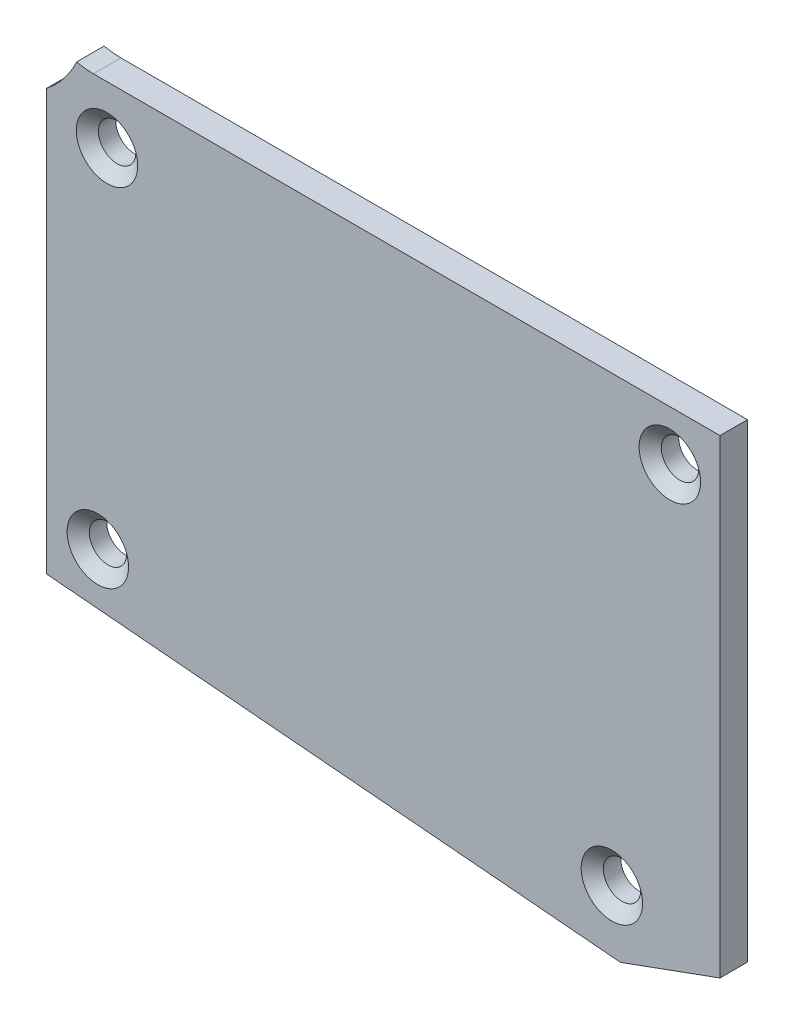
ISO-10303-21;
HEADER;
FILE_DESCRIPTION(('STEP AP214'),'2;1');
FILE_NAME('part.step','',(''),(''),'','','');
FILE_SCHEMA(('AUTOMOTIVE_DESIGN { 1 0 10303 214 1 1 1 1 }'));
ENDSEC;
DATA;
#1=APPLICATION_CONTEXT('core data for automotive mechanical design processes');
#2=APPLICATION_PROTOCOL_DEFINITION('international standard','automotive_design',2000,#1);
#3=PRODUCT_CONTEXT('',#1,'mechanical');
#4=PRODUCT('Part','Part','',(#3));
#5=PRODUCT_RELATED_PRODUCT_CATEGORY('part','',(#4));
#6=PRODUCT_DEFINITION_FORMATION('','',#4);
#7=PRODUCT_DEFINITION_CONTEXT('part definition',#1,'design');
#8=PRODUCT_DEFINITION('design','',#6,#7);
#9=PRODUCT_DEFINITION_SHAPE('','',#8);
#10=(LENGTH_UNIT() NAMED_UNIT(*) SI_UNIT(.MILLI.,.METRE.));
#11=(NAMED_UNIT(*) PLANE_ANGLE_UNIT() SI_UNIT($,.RADIAN.));
#12=(NAMED_UNIT(*) SI_UNIT($,.STERADIAN.) SOLID_ANGLE_UNIT());
#13=UNCERTAINTY_MEASURE_WITH_UNIT(LENGTH_MEASURE(1.E-05),#10,'distance_accuracy_value','');
#14=(GEOMETRIC_REPRESENTATION_CONTEXT(3) GLOBAL_UNCERTAINTY_ASSIGNED_CONTEXT((#13)) GLOBAL_UNIT_ASSIGNED_CONTEXT((#10,
#11,#12)) REPRESENTATION_CONTEXT('',''));
#15=CARTESIAN_POINT('',(0.,0.,0.));
#16=DIRECTION('',(0.,0.,1.));
#17=DIRECTION('',(1.,0.,0.));
#18=AXIS2_PLACEMENT_3D('',#15,#16,#17);
#19=CARTESIAN_POINT('',(-136.525,-18.0339999999997,3.175));
#20=DIRECTION('',(0.,0.,-1.));
#21=DIRECTION('',(-1.,0.,0.));
#22=AXIS2_PLACEMENT_3D('',#19,#20,#21);
#23=CYLINDRICAL_SURFACE('',#22,11.8744999999999);
#24=CARTESIAN_POINT('',(-136.525,-18.0339999999997,0.));
#25=DIRECTION('',(0.,0.,-1.));
#26=DIRECTION('',(1.,0.,0.));
#27=AXIS2_PLACEMENT_3D('',#24,#25,#26);
#28=CIRCLE('',#27,11.8744999999999);
#29=CARTESIAN_POINT('',(-125.746935831468,-23.0176816741256,0.));
#30=VERTEX_POINT('',#29);
#31=CARTESIAN_POINT('',(-129.222499999995,-27.3976127643083,0.));
#32=VERTEX_POINT('',#31);
#33=EDGE_CURVE('E129',#30,#32,#28,.T.);
#34=ORIENTED_EDGE('',*,*,#33,.T.);
#35=DIRECTION('',(0.,0.,-1.));
#36=VECTOR('',#35,1.);
#37=CARTESIAN_POINT('',(-129.222499999995,-27.3976127643083,3.175));
#38=LINE('',#37,#36);
#39=CARTESIAN_POINT('',(-129.222499999995,-27.3976127643083,3.175));
#40=VERTEX_POINT('',#39);
#41=EDGE_CURVE('E11',#40,#32,#38,.T.);
#42=ORIENTED_EDGE('',*,*,#41,.F.);
#43=CARTESIAN_POINT('',(-136.525,-18.0339999999997,3.175));
#44=DIRECTION('',(0.,0.,-1.));
#45=DIRECTION('',(1.,0.,0.));
#46=AXIS2_PLACEMENT_3D('',#43,#44,#45);
#47=CIRCLE('',#46,11.8744999999999);
#48=CARTESIAN_POINT('',(-125.746935831468,-23.0176816741256,3.175));
#49=VERTEX_POINT('',#48);
#50=EDGE_CURVE('E142',#49,#40,#47,.T.);
#51=ORIENTED_EDGE('',*,*,#50,.F.);
#52=DIRECTION('',(0.,0.,-1.));
#53=VECTOR('',#52,1.);
#54=CARTESIAN_POINT('',(-125.746935831468,-23.0176816741256,3.175));
#55=LINE('',#54,#53);
#56=EDGE_CURVE('E125',#49,#30,#55,.T.);
#57=ORIENTED_EDGE('',*,*,#56,.T.);
#58=EDGE_LOOP('',(#34,#42,#51,#57));
#59=FACE_BOUND('',#58,.T.);
#60=ADVANCED_FACE('F37',(#59),#23,.F.);
#61=CARTESIAN_POINT('',(-129.222499999995,-27.3976127643083,3.175));
#62=DIRECTION('',(1.,0.,0.));
#63=DIRECTION('',(0.,1.,0.));
#64=AXIS2_PLACEMENT_3D('',#61,#62,#63);
#65=PLANE('',#64);
#66=DIRECTION('',(0.,-1.,0.));
#67=VECTOR('',#66,1.);
#68=CARTESIAN_POINT('',(-129.222499999995,-27.3976127643083,0.));
#69=LINE('',#68,#67);
#70=CARTESIAN_POINT('',(-129.222499999995,-75.8929380581493,0.));
#71=VERTEX_POINT('',#70);
#72=EDGE_CURVE('E132',#32,#71,#69,.T.);
#73=ORIENTED_EDGE('',*,*,#72,.T.);
#74=DIRECTION('',(0.,0.,-1.));
#75=VECTOR('',#74,1.);
#76=CARTESIAN_POINT('',(-129.222499999995,-75.8929380581493,3.175));
#77=LINE('',#76,#75);
#78=CARTESIAN_POINT('',(-129.222499999995,-75.8929380581493,3.175));
#79=VERTEX_POINT('',#78);
#80=EDGE_CURVE('E45',#79,#71,#77,.T.);
#81=ORIENTED_EDGE('',*,*,#80,.F.);
#82=DIRECTION('',(0.,-1.,0.));
#83=VECTOR('',#82,1.);
#84=CARTESIAN_POINT('',(-129.222499999995,-27.3976127643083,3.175));
#85=LINE('',#84,#83);
#86=EDGE_CURVE('E93',#40,#79,#85,.T.);
#87=ORIENTED_EDGE('',*,*,#86,.F.);
#88=ORIENTED_EDGE('',*,*,#41,.T.);
#89=EDGE_LOOP('',(#73,#81,#87,#88));
#90=FACE_BOUND('',#89,.T.);
#91=ADVANCED_FACE('F230',(#90),#65,.F.);
#92=CARTESIAN_POINT('',(-129.222499999995,-75.8929380581493,3.175));
#93=DIRECTION('',(0.0857273939206466,0.996318630725921,0.));
#94=DIRECTION('',(-0.996318630725921,0.0857273939206466,0.));
#95=AXIS2_PLACEMENT_3D('',#92,#93,#94);
#96=PLANE('',#95);
#97=DIRECTION('',(0.996318630725921,-0.0857273939206466,0.));
#98=VECTOR('',#97,1.);
#99=CARTESIAN_POINT('',(-129.222499999995,-75.8929380581493,0.));
#100=LINE('',#99,#98);
#101=CARTESIAN_POINT('',(-63.0360034414726,-81.5878991757246,0.));
#102=VERTEX_POINT('',#101);
#103=EDGE_CURVE('E135',#71,#102,#100,.T.);
#104=ORIENTED_EDGE('',*,*,#103,.T.);
#105=DIRECTION('',(0.,0.,-1.));
#106=VECTOR('',#105,1.);
#107=CARTESIAN_POINT('',(-63.0360034414726,-81.5878991757246,3.175));
#108=LINE('',#107,#106);
#109=CARTESIAN_POINT('',(-63.0360034414726,-81.5878991757246,3.175));
#110=VERTEX_POINT('',#109);
#111=EDGE_CURVE('E146',#110,#102,#108,.T.);
#112=ORIENTED_EDGE('',*,*,#111,.F.);
#113=DIRECTION('',(0.996318630725921,-0.0857273939206466,0.));
#114=VECTOR('',#113,1.);
#115=CARTESIAN_POINT('',(-129.222499999995,-75.8929380581493,3.175));
#116=LINE('',#115,#114);
#117=EDGE_CURVE('E154',#79,#110,#116,.T.);
#118=ORIENTED_EDGE('',*,*,#117,.F.);
#119=ORIENTED_EDGE('',*,*,#80,.T.);
#120=EDGE_LOOP('',(#104,#112,#118,#119));
#121=FACE_BOUND('',#120,.T.);
#122=ADVANCED_FACE('F152',(#121),#96,.F.);
#123=CARTESIAN_POINT('',(-63.0360034414726,-81.5878991757246,3.175));
#124=DIRECTION('',(-0.342020143325657,0.939692620785913,0.));
#125=DIRECTION('',(-0.939692620785913,-0.342020143325657,0.));
#126=AXIS2_PLACEMENT_3D('',#123,#124,#125);
#127=PLANE('',#126);
#128=DIRECTION('',(0.939692620785913,0.342020143325657,0.));
#129=VECTOR('',#128,1.);
#130=CARTESIAN_POINT('',(-63.0360034414726,-81.5878991757246,0.));
#131=LINE('',#130,#129);
#132=CARTESIAN_POINT('',(-51.5619999999997,-77.4117034551607,0.));
#133=VERTEX_POINT('',#132);
#134=EDGE_CURVE('E137',#102,#133,#131,.T.);
#135=ORIENTED_EDGE('',*,*,#134,.T.);
#136=DIRECTION('',(0.,0.,-1.));
#137=VECTOR('',#136,1.);
#138=CARTESIAN_POINT('',(-51.5619999999997,-77.4117034551607,3.175));
#139=LINE('',#138,#137);
#140=CARTESIAN_POINT('',(-51.5619999999997,-77.4117034551607,3.175));
#141=VERTEX_POINT('',#140);
#142=EDGE_CURVE('E118',#141,#133,#139,.T.);
#143=ORIENTED_EDGE('',*,*,#142,.F.);
#144=DIRECTION('',(0.939692620785913,0.342020143325657,0.));
#145=VECTOR('',#144,1.);
#146=CARTESIAN_POINT('',(-63.0360034414726,-81.5878991757246,3.175));
#147=LINE('',#146,#145);
#148=EDGE_CURVE('E109',#110,#141,#147,.T.);
#149=ORIENTED_EDGE('',*,*,#148,.F.);
#150=ORIENTED_EDGE('',*,*,#111,.T.);
#151=EDGE_LOOP('',(#135,#143,#149,#150));
#152=FACE_BOUND('',#151,.T.);
#153=ADVANCED_FACE('F160',(#152),#127,.F.);
#154=CARTESIAN_POINT('',(-51.5619999999997,-77.4117034551607,3.175));
#155=DIRECTION('',(-1.,0.,0.));
#156=DIRECTION('',(0.,0.,1.));
#157=AXIS2_PLACEMENT_3D('',#154,#155,#156);
#158=PLANE('',#157);
#159=DIRECTION('',(0.,1.,0.));
#160=VECTOR('',#159,1.);
#161=CARTESIAN_POINT('',(-51.5619999999997,-77.4117034551607,0.));
#162=LINE('',#161,#160);
#163=CARTESIAN_POINT('',(-51.5619999999997,-23.2409999999997,0.));
#164=VERTEX_POINT('',#163);
#165=EDGE_CURVE('E117',#133,#164,#162,.T.);
#166=ORIENTED_EDGE('',*,*,#165,.T.);
#167=DIRECTION('',(0.,0.,-1.));
#168=VECTOR('',#167,1.);
#169=CARTESIAN_POINT('',(-51.5619999999997,-23.2409999999997,3.175));
#170=LINE('',#169,#168);
#171=CARTESIAN_POINT('',(-51.5619999999997,-23.2409999999997,3.175));
#172=VERTEX_POINT('',#171);
#173=EDGE_CURVE('E114',#172,#164,#170,.T.);
#174=ORIENTED_EDGE('',*,*,#173,.F.);
#175=DIRECTION('',(0.,1.,0.));
#176=VECTOR('',#175,1.);
#177=CARTESIAN_POINT('',(-51.5619999999997,-77.4117034551607,3.175));
#178=LINE('',#177,#176);
#179=EDGE_CURVE('E103',#141,#172,#178,.T.);
#180=ORIENTED_EDGE('',*,*,#179,.F.);
#181=ORIENTED_EDGE('',*,*,#142,.T.);
#182=EDGE_LOOP('',(#166,#174,#180,#181));
#183=FACE_BOUND('',#182,.T.);
#184=ADVANCED_FACE('F115',(#183),#158,.F.);
#185=CARTESIAN_POINT('',(-51.5619999999997,-23.2409999999997,3.175));
#186=DIRECTION('',(0.,-1.,0.));
#187=DIRECTION('',(0.,0.,-1.));
#188=AXIS2_PLACEMENT_3D('',#185,#186,#187);
#189=PLANE('',#188);
#190=DIRECTION('',(-1.,0.,0.));
#191=VECTOR('',#190,1.);
#192=CARTESIAN_POINT('',(-51.5619999999997,-23.2409999999997,0.));
#193=LINE('',#192,#191);
#194=CARTESIAN_POINT('',(-123.825,-23.2409999999997,0.));
#195=VERTEX_POINT('',#194);
#196=EDGE_CURVE('E79',#164,#195,#193,.T.);
#197=ORIENTED_EDGE('',*,*,#196,.T.);
#198=DIRECTION('',(0.,0.,-1.));
#199=VECTOR('',#198,1.);
#200=CARTESIAN_POINT('',(-123.825,-23.2409999999997,3.175));
#201=LINE('',#200,#199);
#202=CARTESIAN_POINT('',(-123.825,-23.2409999999997,3.175));
#203=VERTEX_POINT('',#202);
#204=EDGE_CURVE('E119',#203,#195,#201,.T.);
#205=ORIENTED_EDGE('',*,*,#204,.F.);
#206=DIRECTION('',(-1.,0.,0.));
#207=VECTOR('',#206,1.);
#208=CARTESIAN_POINT('',(-51.5619999999997,-23.2409999999997,3.175));
#209=LINE('',#208,#207);
#210=EDGE_CURVE('E107',#172,#203,#209,.T.);
#211=ORIENTED_EDGE('',*,*,#210,.F.);
#212=ORIENTED_EDGE('',*,*,#173,.T.);
#213=EDGE_LOOP('',(#197,#205,#211,#212));
#214=FACE_BOUND('',#213,.T.);
#215=ADVANCED_FACE('F121',(#214),#189,.F.);
#216=CARTESIAN_POINT('',(-123.825,-14.8589999999997,3.175));
#217=DIRECTION('',(0.,0.,-1.));
#218=DIRECTION('',(-1.,0.,0.));
#219=AXIS2_PLACEMENT_3D('',#216,#217,#218);
#220=CYLINDRICAL_SURFACE('',#219,8.382);
#221=CARTESIAN_POINT('',(-123.825,-14.8589999999997,0.));
#222=DIRECTION('',(0.,0.,-1.));
#223=DIRECTION('',(1.,0.,0.));
#224=AXIS2_PLACEMENT_3D('',#221,#222,#223);
#225=CIRCLE('',#224,8.382);
#226=EDGE_CURVE('E85',#195,#30,#225,.T.);
#227=ORIENTED_EDGE('',*,*,#226,.T.);
#228=ORIENTED_EDGE('',*,*,#56,.F.);
#229=CARTESIAN_POINT('',(-123.825,-14.8589999999997,3.175));
#230=DIRECTION('',(0.,0.,-1.));
#231=DIRECTION('',(1.,0.,0.));
#232=AXIS2_PLACEMENT_3D('',#229,#230,#231);
#233=CIRCLE('',#232,8.382);
#234=EDGE_CURVE('E53',#203,#49,#233,.T.);
#235=ORIENTED_EDGE('',*,*,#234,.F.);
#236=ORIENTED_EDGE('',*,*,#204,.T.);
#237=EDGE_LOOP('',(#227,#228,#235,#236));
#238=FACE_BOUND('',#237,.T.);
#239=ADVANCED_FACE('F205',(#238),#220,.F.);
#240=CARTESIAN_POINT('',(-136.525,-18.0339999999997,3.175));
#241=DIRECTION('',(0.,0.,1.));
#242=DIRECTION('',(1.,0.,0.));
#243=AXIS2_PLACEMENT_3D('',#240,#241,#242);
#244=PLANE('',#243);
#245=CARTESIAN_POINT('',(-123.300524073936,-70.4586320078478,3.175));
#246=DIRECTION('',(0.,0.,1.));
#247=DIRECTION('',(1.,0.,0.));
#248=AXIS2_PLACEMENT_3D('',#245,#246,#247);
#249=CIRCLE('',#248,3.5433);
#250=CARTESIAN_POINT('',(-119.757224073936,-70.4586320078478,3.175));
#251=VERTEX_POINT('',#250);
#252=EDGE_CURVE('E197',#251,#251,#249,.T.);
#253=ORIENTED_EDGE('',*,*,#252,.F.);
#254=EDGE_LOOP('',(#253));
#255=FACE_BOUND('',#254,.T.);
#256=CARTESIAN_POINT('',(-122.245302558132,-29.8697342006362,3.175));
#257=DIRECTION('',(0.,0.,1.));
#258=DIRECTION('',(1.,0.,0.));
#259=AXIS2_PLACEMENT_3D('',#256,#257,#258);
#260=CIRCLE('',#259,3.5433);
#261=CARTESIAN_POINT('',(-118.702002558132,-29.8697342006362,3.175));
#262=VERTEX_POINT('',#261);
#263=EDGE_CURVE('E188',#262,#262,#260,.T.);
#264=ORIENTED_EDGE('',*,*,#263,.F.);
#265=EDGE_LOOP('',(#264));
#266=FACE_BOUND('',#265,.T.);
#267=CARTESIAN_POINT('',(-57.3425960454007,-29.0215960454006,3.175));
#268=DIRECTION('',(0.,0.,1.));
#269=DIRECTION('',(1.,0.,0.));
#270=AXIS2_PLACEMENT_3D('',#267,#268,#269);
#271=CIRCLE('',#270,3.5433);
#272=CARTESIAN_POINT('',(-53.7992960454007,-29.0215960454006,3.175));
#273=VERTEX_POINT('',#272);
#274=EDGE_CURVE('E179',#273,#273,#271,.T.);
#275=ORIENTED_EDGE('',*,*,#274,.F.);
#276=EDGE_LOOP('',(#275));
#277=FACE_BOUND('',#276,.T.);
#278=CARTESIAN_POINT('',(-64.0251228295495,-74.4222072931071,3.175));
#279=DIRECTION('',(0.,0.,1.));
#280=DIRECTION('',(1.,0.,0.));
#281=AXIS2_PLACEMENT_3D('',#278,#279,#280);
#282=CIRCLE('',#281,3.5433);
#283=CARTESIAN_POINT('',(-60.4818228295495,-74.4222072931071,3.175));
#284=VERTEX_POINT('',#283);
#285=EDGE_CURVE('E170',#284,#284,#282,.T.);
#286=ORIENTED_EDGE('',*,*,#285,.F.);
#287=EDGE_LOOP('',(#286));
#288=FACE_BOUND('',#287,.T.);
#289=ORIENTED_EDGE('',*,*,#50,.T.);
#290=ORIENTED_EDGE('',*,*,#86,.T.);
#291=ORIENTED_EDGE('',*,*,#117,.T.);
#292=ORIENTED_EDGE('',*,*,#148,.T.);
#293=ORIENTED_EDGE('',*,*,#179,.T.);
#294=ORIENTED_EDGE('',*,*,#210,.T.);
#295=ORIENTED_EDGE('',*,*,#234,.T.);
#296=EDGE_LOOP('',(#289,#290,#291,#292,#293,#294,#295));
#297=FACE_BOUND('',#296,.T.);
#298=ADVANCED_FACE('F105',(#255,#266,#277,#288,#297),#244,.T.);
#299=CARTESIAN_POINT('',(-136.525,-18.0339999999997,0.));
#300=DIRECTION('',(0.,0.,1.));
#301=DIRECTION('',(1.,0.,0.));
#302=AXIS2_PLACEMENT_3D('',#299,#300,#301);
#303=PLANE('',#302);
#304=CARTESIAN_POINT('',(-123.300524073936,-70.4586320078478,0.));
#305=DIRECTION('',(0.,0.,1.));
#306=DIRECTION('',(1.,0.,0.));
#307=AXIS2_PLACEMENT_3D('',#304,#305,#306);
#308=CIRCLE('',#307,2.15265);
#309=CARTESIAN_POINT('',(-121.147874073936,-70.4586320078478,0.));
#310=VERTEX_POINT('',#309);
#311=EDGE_CURVE('E191',#310,#310,#308,.T.);
#312=ORIENTED_EDGE('',*,*,#311,.T.);
#313=EDGE_LOOP('',(#312));
#314=FACE_BOUND('',#313,.T.);
#315=CARTESIAN_POINT('',(-122.245302558132,-29.8697342006362,0.));
#316=DIRECTION('',(0.,0.,1.));
#317=DIRECTION('',(1.,0.,0.));
#318=AXIS2_PLACEMENT_3D('',#315,#316,#317);
#319=CIRCLE('',#318,2.15265);
#320=CARTESIAN_POINT('',(-120.092652558132,-29.8697342006362,0.));
#321=VERTEX_POINT('',#320);
#322=EDGE_CURVE('E182',#321,#321,#319,.T.);
#323=ORIENTED_EDGE('',*,*,#322,.T.);
#324=EDGE_LOOP('',(#323));
#325=FACE_BOUND('',#324,.T.);
#326=CARTESIAN_POINT('',(-57.3425960454007,-29.0215960454006,0.));
#327=DIRECTION('',(0.,0.,1.));
#328=DIRECTION('',(1.,0.,0.));
#329=AXIS2_PLACEMENT_3D('',#326,#327,#328);
#330=CIRCLE('',#329,2.15265);
#331=CARTESIAN_POINT('',(-55.1899460454007,-29.0215960454006,0.));
#332=VERTEX_POINT('',#331);
#333=EDGE_CURVE('E173',#332,#332,#330,.T.);
#334=ORIENTED_EDGE('',*,*,#333,.T.);
#335=EDGE_LOOP('',(#334));
#336=FACE_BOUND('',#335,.T.);
#337=CARTESIAN_POINT('',(-64.0251228295495,-74.4222072931071,0.));
#338=DIRECTION('',(0.,0.,1.));
#339=DIRECTION('',(1.,0.,0.));
#340=AXIS2_PLACEMENT_3D('',#337,#338,#339);
#341=CIRCLE('',#340,2.15265);
#342=CARTESIAN_POINT('',(-61.8724728295495,-74.4222072931071,0.));
#343=VERTEX_POINT('',#342);
#344=EDGE_CURVE('E133',#343,#343,#341,.T.);
#345=ORIENTED_EDGE('',*,*,#344,.T.);
#346=EDGE_LOOP('',(#345));
#347=FACE_BOUND('',#346,.T.);
#348=ORIENTED_EDGE('',*,*,#33,.F.);
#349=ORIENTED_EDGE('',*,*,#226,.F.);
#350=ORIENTED_EDGE('',*,*,#196,.F.);
#351=ORIENTED_EDGE('',*,*,#165,.F.);
#352=ORIENTED_EDGE('',*,*,#134,.F.);
#353=ORIENTED_EDGE('',*,*,#103,.F.);
#354=ORIENTED_EDGE('',*,*,#72,.F.);
#355=EDGE_LOOP('',(#348,#349,#350,#351,#352,#353,#354));
#356=FACE_BOUND('',#355,.T.);
#357=ADVANCED_FACE('F158',(#314,#325,#336,#347,#356),#303,.F.);
#358=CARTESIAN_POINT('',(-64.0251228295495,-74.4222072931071,3.175));
#359=DIRECTION('',(0.,0.,1.));
#360=DIRECTION('',(1.,0.,0.));
#361=AXIS2_PLACEMENT_3D('',#358,#359,#360);
#362=CYLINDRICAL_SURFACE('',#361,2.15265);
#363=ORIENTED_EDGE('',*,*,#344,.F.);
#364=EDGE_LOOP('',(#363));
#365=FACE_BOUND('',#364,.T.);
#366=CARTESIAN_POINT('',(-64.0251228295495,-74.4222072931071,2.00810609790331));
#367=DIRECTION('',(0.,0.,1.));
#368=DIRECTION('',(1.,0.,0.));
#369=AXIS2_PLACEMENT_3D('',#366,#367,#368);
#370=CIRCLE('',#369,2.15265);
#371=CARTESIAN_POINT('',(-61.8724728295495,-74.4222072931071,2.00810609790331));
#372=VERTEX_POINT('',#371);
#373=EDGE_CURVE('E167',#372,#372,#370,.T.);
#374=ORIENTED_EDGE('',*,*,#373,.T.);
#375=EDGE_LOOP('',(#374));
#376=FACE_BOUND('',#375,.T.);
#377=ADVANCED_FACE('F216',(#365,#376),#362,.F.);
#378=CARTESIAN_POINT('',(-64.0251228295495,-74.4222072931071,3.175));
#379=DIRECTION('',(0.,0.,1.));
#380=DIRECTION('',(1.,0.,0.));
#381=AXIS2_PLACEMENT_3D('',#378,#379,#380);
#382=CONICAL_SURFACE('',#381,3.5433,0.872664625997163);
#383=ORIENTED_EDGE('',*,*,#373,.F.);
#384=EDGE_LOOP('',(#383));
#385=FACE_BOUND('',#384,.T.);
#386=ORIENTED_EDGE('',*,*,#285,.T.);
#387=EDGE_LOOP('',(#386));
#388=FACE_BOUND('',#387,.T.);
#389=ADVANCED_FACE('F213',(#385,#388),#382,.F.);
#390=CARTESIAN_POINT('',(-57.3425960454007,-29.0215960454006,3.175));
#391=DIRECTION('',(0.,0.,1.));
#392=DIRECTION('',(1.,0.,0.));
#393=AXIS2_PLACEMENT_3D('',#390,#391,#392);
#394=CYLINDRICAL_SURFACE('',#393,2.15265);
#395=ORIENTED_EDGE('',*,*,#333,.F.);
#396=EDGE_LOOP('',(#395));
#397=FACE_BOUND('',#396,.T.);
#398=CARTESIAN_POINT('',(-57.3425960454007,-29.0215960454006,2.00810609790331));
#399=DIRECTION('',(0.,0.,1.));
#400=DIRECTION('',(1.,0.,0.));
#401=AXIS2_PLACEMENT_3D('',#398,#399,#400);
#402=CIRCLE('',#401,2.15265);
#403=CARTESIAN_POINT('',(-55.1899460454007,-29.0215960454006,2.00810609790331));
#404=VERTEX_POINT('',#403);
#405=EDGE_CURVE('E176',#404,#404,#402,.T.);
#406=ORIENTED_EDGE('',*,*,#405,.T.);
#407=EDGE_LOOP('',(#406));
#408=FACE_BOUND('',#407,.T.);
#409=ADVANCED_FACE('F215',(#397,#408),#394,.F.);
#410=CARTESIAN_POINT('',(-57.3425960454007,-29.0215960454006,3.175));
#411=DIRECTION('',(0.,0.,1.));
#412=DIRECTION('',(1.,0.,0.));
#413=AXIS2_PLACEMENT_3D('',#410,#411,#412);
#414=CONICAL_SURFACE('',#413,3.5433,0.872664625997163);
#415=ORIENTED_EDGE('',*,*,#405,.F.);
#416=EDGE_LOOP('',(#415));
#417=FACE_BOUND('',#416,.T.);
#418=ORIENTED_EDGE('',*,*,#274,.T.);
#419=EDGE_LOOP('',(#418));
#420=FACE_BOUND('',#419,.T.);
#421=ADVANCED_FACE('F223',(#417,#420),#414,.F.);
#422=CARTESIAN_POINT('',(-122.245302558132,-29.8697342006362,3.175));
#423=DIRECTION('',(0.,0.,1.));
#424=DIRECTION('',(1.,0.,0.));
#425=AXIS2_PLACEMENT_3D('',#422,#423,#424);
#426=CYLINDRICAL_SURFACE('',#425,2.15265);
#427=ORIENTED_EDGE('',*,*,#322,.F.);
#428=EDGE_LOOP('',(#427));
#429=FACE_BOUND('',#428,.T.);
#430=CARTESIAN_POINT('',(-122.245302558132,-29.8697342006362,2.00810609790331));
#431=DIRECTION('',(0.,0.,1.));
#432=DIRECTION('',(1.,0.,0.));
#433=AXIS2_PLACEMENT_3D('',#430,#431,#432);
#434=CIRCLE('',#433,2.15264999999999);
#435=CARTESIAN_POINT('',(-120.092652558132,-29.8697342006362,2.00810609790331));
#436=VERTEX_POINT('',#435);
#437=EDGE_CURVE('E185',#436,#436,#434,.T.);
#438=ORIENTED_EDGE('',*,*,#437,.T.);
#439=EDGE_LOOP('',(#438));
#440=FACE_BOUND('',#439,.T.);
#441=ADVANCED_FACE('F325',(#429,#440),#426,.F.);
#442=CARTESIAN_POINT('',(-122.245302558132,-29.8697342006362,3.175));
#443=DIRECTION('',(0.,0.,1.));
#444=DIRECTION('',(1.,0.,0.));
#445=AXIS2_PLACEMENT_3D('',#442,#443,#444);
#446=CONICAL_SURFACE('',#445,3.5433,0.872664625997166);
#447=ORIENTED_EDGE('',*,*,#437,.F.);
#448=EDGE_LOOP('',(#447));
#449=FACE_BOUND('',#448,.T.);
#450=ORIENTED_EDGE('',*,*,#263,.T.);
#451=EDGE_LOOP('',(#450));
#452=FACE_BOUND('',#451,.T.);
#453=ADVANCED_FACE('F334',(#449,#452),#446,.F.);
#454=CARTESIAN_POINT('',(-123.300524073936,-70.4586320078478,3.175));
#455=DIRECTION('',(0.,0.,1.));
#456=DIRECTION('',(1.,0.,0.));
#457=AXIS2_PLACEMENT_3D('',#454,#455,#456);
#458=CYLINDRICAL_SURFACE('',#457,2.15265);
#459=ORIENTED_EDGE('',*,*,#311,.F.);
#460=EDGE_LOOP('',(#459));
#461=FACE_BOUND('',#460,.T.);
#462=CARTESIAN_POINT('',(-123.300524073936,-70.4586320078478,2.00810609790331));
#463=DIRECTION('',(0.,0.,1.));
#464=DIRECTION('',(1.,0.,0.));
#465=AXIS2_PLACEMENT_3D('',#462,#463,#464);
#466=CIRCLE('',#465,2.15264999999999);
#467=CARTESIAN_POINT('',(-121.147874073936,-70.4586320078478,2.00810609790331));
#468=VERTEX_POINT('',#467);
#469=EDGE_CURVE('E194',#468,#468,#466,.T.);
#470=ORIENTED_EDGE('',*,*,#469,.T.);
#471=EDGE_LOOP('',(#470));
#472=FACE_BOUND('',#471,.T.);
#473=ADVANCED_FACE('F343',(#461,#472),#458,.F.);
#474=CARTESIAN_POINT('',(-123.300524073936,-70.4586320078478,3.175));
#475=DIRECTION('',(0.,0.,1.));
#476=DIRECTION('',(1.,0.,0.));
#477=AXIS2_PLACEMENT_3D('',#474,#475,#476);
#478=CONICAL_SURFACE('',#477,3.5433,0.872664625997166);
#479=ORIENTED_EDGE('',*,*,#469,.F.);
#480=EDGE_LOOP('',(#479));
#481=FACE_BOUND('',#480,.T.);
#482=ORIENTED_EDGE('',*,*,#252,.T.);
#483=EDGE_LOOP('',(#482));
#484=FACE_BOUND('',#483,.T.);
#485=ADVANCED_FACE('F201',(#481,#484),#478,.F.);
#486=CLOSED_SHELL('',(#60,#91,#122,#153,#184,#215,#239,#298,#357,#377,#389,#409,#421,#441,#453,
#473,#485));
#487=MANIFOLD_SOLID_BREP('B2',#486);
#488=ADVANCED_BREP_SHAPE_REPRESENTATION('',(#18,#487),#14);
#489=SHAPE_DEFINITION_REPRESENTATION(#9,#488);
ENDSEC;
END-ISO-10303-21;
